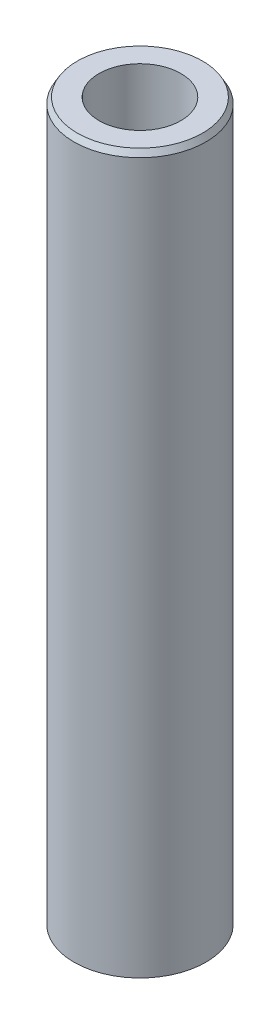
ISO-10303-21;
HEADER;
FILE_DESCRIPTION(('STEP AP214'),'2;1');
FILE_NAME('part.step','',(''),(''),'','','');
FILE_SCHEMA(('AUTOMOTIVE_DESIGN { 1 0 10303 214 1 1 1 1 }'));
ENDSEC;
DATA;
#1=APPLICATION_CONTEXT('core data for automotive mechanical design processes');
#2=APPLICATION_PROTOCOL_DEFINITION('international standard','automotive_design',2000,#1);
#3=PRODUCT_CONTEXT('',#1,'mechanical');
#4=PRODUCT('Part','Part','',(#3));
#5=PRODUCT_RELATED_PRODUCT_CATEGORY('part','',(#4));
#6=PRODUCT_DEFINITION_FORMATION('','',#4);
#7=PRODUCT_DEFINITION_CONTEXT('part definition',#1,'design');
#8=PRODUCT_DEFINITION('design','',#6,#7);
#9=PRODUCT_DEFINITION_SHAPE('','',#8);
#10=(LENGTH_UNIT() NAMED_UNIT(*) SI_UNIT(.MILLI.,.METRE.));
#11=(NAMED_UNIT(*) PLANE_ANGLE_UNIT() SI_UNIT($,.RADIAN.));
#12=(NAMED_UNIT(*) SI_UNIT($,.STERADIAN.) SOLID_ANGLE_UNIT());
#13=UNCERTAINTY_MEASURE_WITH_UNIT(LENGTH_MEASURE(1.E-05),#10,'distance_accuracy_value','');
#14=(GEOMETRIC_REPRESENTATION_CONTEXT(3) GLOBAL_UNCERTAINTY_ASSIGNED_CONTEXT((#13)) GLOBAL_UNIT_ASSIGNED_CONTEXT((#10,
#11,#12)) REPRESENTATION_CONTEXT('',''));
#15=CARTESIAN_POINT('',(0.,0.,0.));
#16=DIRECTION('',(0.,0.,1.));
#17=DIRECTION('',(1.,0.,0.));
#18=AXIS2_PLACEMENT_3D('',#15,#16,#17);
#19=CARTESIAN_POINT('',(0.,600.,0.));
#20=DIRECTION('',(0.,-1.,0.));
#21=DIRECTION('',(0.,0.,-1.));
#22=AXIS2_PLACEMENT_3D('',#19,#20,#21);
#23=CYLINDRICAL_SURFACE('',#22,55.);
#24=CARTESIAN_POINT('',(0.,595.077477474304,0.));
#25=DIRECTION('',(0.,1.,0.));
#26=DIRECTION('',(0.,0.,1.));
#27=AXIS2_PLACEMENT_3D('',#24,#25,#26);
#28=CIRCLE('',#27,55.);
#29=CARTESIAN_POINT('',(0.,595.077477474304,55.));
#30=VERTEX_POINT('',#29);
#31=EDGE_CURVE('E50',#30,#30,#28,.F.);
#32=ORIENTED_EDGE('',*,*,#31,.T.);
#33=EDGE_LOOP('',(#32));
#34=FACE_BOUND('',#33,.T.);
#35=CARTESIAN_POINT('',(0.,2.84201970530251,0.));
#36=DIRECTION('',(0.,1.,0.));
#37=DIRECTION('',(0.,0.,1.));
#38=AXIS2_PLACEMENT_3D('',#35,#36,#37);
#39=CIRCLE('',#38,55.);
#40=CARTESIAN_POINT('',(0.,2.84201970530251,55.));
#41=VERTEX_POINT('',#40);
#42=EDGE_CURVE('E51',#41,#41,#39,.T.);
#43=ORIENTED_EDGE('',*,*,#42,.T.);
#44=EDGE_LOOP('',(#43));
#45=FACE_BOUND('',#44,.T.);
#46=ADVANCED_FACE('F39',(#34,#45),#23,.T.);
#47=CARTESIAN_POINT('',(0.,600.,0.));
#48=DIRECTION('',(0.,1.,0.));
#49=DIRECTION('',(0.,0.,1.));
#50=AXIS2_PLACEMENT_3D('',#47,#48,#49);
#51=PLANE('',#50);
#52=CARTESIAN_POINT('',(0.,600.,0.));
#53=DIRECTION('',(0.,1.,0.));
#54=DIRECTION('',(0.,0.,1.));
#55=AXIS2_PLACEMENT_3D('',#52,#53,#54);
#56=CIRCLE('',#55,52.1579802946975);
#57=CARTESIAN_POINT('',(0.,600.,52.1579802946975));
#58=VERTEX_POINT('',#57);
#59=EDGE_CURVE('E54',#58,#58,#56,.T.);
#60=ORIENTED_EDGE('',*,*,#59,.T.);
#61=EDGE_LOOP('',(#60));
#62=FACE_BOUND('',#61,.T.);
#63=CARTESIAN_POINT('',(0.,600.,0.));
#64=DIRECTION('',(0.,1.,0.));
#65=DIRECTION('',(0.,0.,1.));
#66=AXIS2_PLACEMENT_3D('',#63,#64,#65);
#67=CIRCLE('',#66,34.1090519122688);
#68=CARTESIAN_POINT('',(0.,600.,34.1090519122688));
#69=VERTEX_POINT('',#68);
#70=EDGE_CURVE('E58',#69,#69,#67,.T.);
#71=ORIENTED_EDGE('',*,*,#70,.F.);
#72=EDGE_LOOP('',(#71));
#73=FACE_BOUND('',#72,.T.);
#74=ADVANCED_FACE('F69',(#62,#73),#51,.T.);
#75=CARTESIAN_POINT('',(0.,0.,0.));
#76=DIRECTION('',(0.,1.,0.));
#77=DIRECTION('',(0.,0.,1.));
#78=AXIS2_PLACEMENT_3D('',#75,#76,#77);
#79=PLANE('',#78);
#80=CARTESIAN_POINT('',(0.,0.,0.));
#81=DIRECTION('',(0.,1.,0.));
#82=DIRECTION('',(0.,0.,1.));
#83=AXIS2_PLACEMENT_3D('',#80,#81,#82);
#84=CIRCLE('',#83,50.077477474304);
#85=CARTESIAN_POINT('',(0.,0.,50.077477474304));
#86=VERTEX_POINT('',#85);
#87=EDGE_CURVE('E10',#86,#86,#84,.F.);
#88=ORIENTED_EDGE('',*,*,#87,.T.);
#89=EDGE_LOOP('',(#88));
#90=FACE_BOUND('',#89,.T.);
#91=CARTESIAN_POINT('',(0.,0.,0.));
#92=DIRECTION('',(0.,1.,0.));
#93=DIRECTION('',(0.,0.,1.));
#94=AXIS2_PLACEMENT_3D('',#91,#92,#93);
#95=CIRCLE('',#94,34.1090519122688);
#96=CARTESIAN_POINT('',(0.,0.,34.1090519122688));
#97=VERTEX_POINT('',#96);
#98=EDGE_CURVE('E63',#97,#97,#95,.T.);
#99=ORIENTED_EDGE('',*,*,#98,.T.);
#100=EDGE_LOOP('',(#99));
#101=FACE_BOUND('',#100,.T.);
#102=ADVANCED_FACE('F75',(#90,#101),#79,.F.);
#103=CARTESIAN_POINT('',(0.,600.,0.));
#104=DIRECTION('',(0.,-1.,0.));
#105=DIRECTION('',(0.,0.,-1.));
#106=AXIS2_PLACEMENT_3D('',#103,#104,#105);
#107=CYLINDRICAL_SURFACE('',#106,34.1090519122688);
#108=ORIENTED_EDGE('',*,*,#70,.T.);
#109=EDGE_LOOP('',(#108));
#110=FACE_BOUND('',#109,.T.);
#111=ORIENTED_EDGE('',*,*,#98,.F.);
#112=EDGE_LOOP('',(#111));
#113=FACE_BOUND('',#112,.T.);
#114=ADVANCED_FACE('F70',(#110,#113),#107,.F.);
#115=CARTESIAN_POINT('',(0.,600.,0.));
#116=DIRECTION('',(0.,-1.,0.));
#117=DIRECTION('',(0.,0.,-1.));
#118=AXIS2_PLACEMENT_3D('',#115,#116,#117);
#119=CONICAL_SURFACE('',#118,52.1579802946975,0.523598775598288);
#120=ORIENTED_EDGE('',*,*,#31,.F.);
#121=EDGE_LOOP('',(#120));
#122=FACE_BOUND('',#121,.T.);
#123=ORIENTED_EDGE('',*,*,#59,.F.);
#124=EDGE_LOOP('',(#123));
#125=FACE_BOUND('',#124,.T.);
#126=ADVANCED_FACE('F81',(#122,#125),#119,.T.);
#127=CARTESIAN_POINT('',(0.,2.84201970530251,0.));
#128=DIRECTION('',(0.,1.,0.));
#129=DIRECTION('',(0.,0.,1.));
#130=AXIS2_PLACEMENT_3D('',#127,#128,#129);
#131=CONICAL_SURFACE('',#130,55.,1.04719755119661);
#132=ORIENTED_EDGE('',*,*,#87,.F.);
#133=EDGE_LOOP('',(#132));
#134=FACE_BOUND('',#133,.T.);
#135=ORIENTED_EDGE('',*,*,#42,.F.);
#136=EDGE_LOOP('',(#135));
#137=FACE_BOUND('',#136,.T.);
#138=ADVANCED_FACE('F45',(#134,#137),#131,.T.);
#139=CLOSED_SHELL('',(#46,#74,#102,#114,#126,#138));
#140=MANIFOLD_SOLID_BREP('B2',#139);
#141=ADVANCED_BREP_SHAPE_REPRESENTATION('',(#18,#140),#14);
#142=SHAPE_DEFINITION_REPRESENTATION(#9,#141);
ENDSEC;
END-ISO-10303-21;
